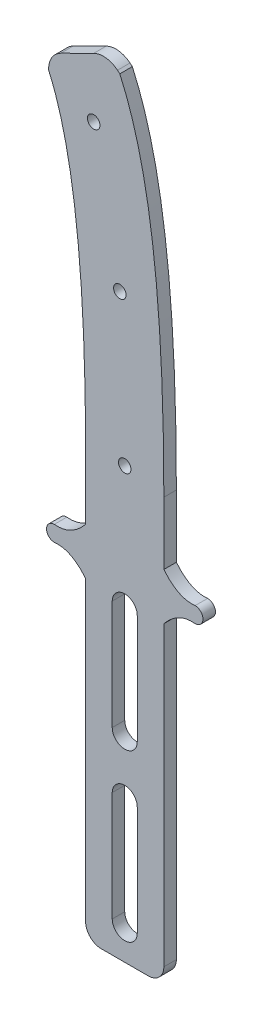
ISO-10303-21;
HEADER;
FILE_DESCRIPTION(('STEP AP214'),'2;1');
FILE_NAME('part.step','',(''),(''),'','','');
FILE_SCHEMA(('AUTOMOTIVE_DESIGN { 1 0 10303 214 1 1 1 1 }'));
ENDSEC;
DATA;
#1=APPLICATION_CONTEXT('core data for automotive mechanical design processes');
#2=APPLICATION_PROTOCOL_DEFINITION('international standard','automotive_design',2000,#1);
#3=PRODUCT_CONTEXT('',#1,'mechanical');
#4=PRODUCT('Part','Part','',(#3));
#5=PRODUCT_RELATED_PRODUCT_CATEGORY('part','',(#4));
#6=PRODUCT_DEFINITION_FORMATION('','',#4);
#7=PRODUCT_DEFINITION_CONTEXT('part definition',#1,'design');
#8=PRODUCT_DEFINITION('design','',#6,#7);
#9=PRODUCT_DEFINITION_SHAPE('','',#8);
#10=(LENGTH_UNIT() NAMED_UNIT(*) SI_UNIT(.MILLI.,.METRE.));
#11=(NAMED_UNIT(*) PLANE_ANGLE_UNIT() SI_UNIT($,.RADIAN.));
#12=(NAMED_UNIT(*) SI_UNIT($,.STERADIAN.) SOLID_ANGLE_UNIT());
#13=UNCERTAINTY_MEASURE_WITH_UNIT(LENGTH_MEASURE(1.E-05),#10,'distance_accuracy_value','');
#14=(GEOMETRIC_REPRESENTATION_CONTEXT(3) GLOBAL_UNCERTAINTY_ASSIGNED_CONTEXT((#13)) GLOBAL_UNIT_ASSIGNED_CONTEXT((#10,
#11,#12)) REPRESENTATION_CONTEXT('',''));
#15=CARTESIAN_POINT('',(0.,0.,0.));
#16=DIRECTION('',(0.,0.,1.));
#17=DIRECTION('',(1.,0.,0.));
#18=AXIS2_PLACEMENT_3D('',#15,#16,#17);
#19=CARTESIAN_POINT('',(12.4999999999998,78.,4.));
#20=DIRECTION('',(0.,0.,-1.));
#21=DIRECTION('',(-1.,0.,0.));
#22=AXIS2_PLACEMENT_3D('',#19,#20,#21);
#23=CYLINDRICAL_SURFACE('',#22,4.);
#24=CARTESIAN_POINT('',(12.4999999999998,78.,0.));
#25=DIRECTION('',(0.,0.,1.));
#26=DIRECTION('',(1.,0.,0.));
#27=AXIS2_PLACEMENT_3D('',#24,#25,#26);
#28=CIRCLE('',#27,4.);
#29=CARTESIAN_POINT('',(16.4999999999998,78.,0.));
#30=VERTEX_POINT('',#29);
#31=CARTESIAN_POINT('',(8.49999999999982,78.,0.));
#32=VERTEX_POINT('',#31);
#33=EDGE_CURVE('E361',#30,#32,#28,.T.);
#34=ORIENTED_EDGE('',*,*,#33,.F.);
#35=DIRECTION('',(0.,0.,-1.));
#36=VECTOR('',#35,1.);
#37=CARTESIAN_POINT('',(16.4999999999998,78.,4.));
#38=LINE('',#37,#36);
#39=CARTESIAN_POINT('',(16.4999999999998,78.,4.));
#40=VERTEX_POINT('',#39);
#41=EDGE_CURVE('E11',#40,#30,#38,.T.);
#42=ORIENTED_EDGE('',*,*,#41,.F.);
#43=CARTESIAN_POINT('',(12.4999999999998,78.,4.));
#44=DIRECTION('',(0.,0.,1.));
#45=DIRECTION('',(1.,0.,0.));
#46=AXIS2_PLACEMENT_3D('',#43,#44,#45);
#47=CIRCLE('',#46,4.);
#48=CARTESIAN_POINT('',(8.49999999999982,78.,4.));
#49=VERTEX_POINT('',#48);
#50=EDGE_CURVE('E247',#40,#49,#47,.T.);
#51=ORIENTED_EDGE('',*,*,#50,.T.);
#52=DIRECTION('',(0.,0.,-1.));
#53=VECTOR('',#52,1.);
#54=CARTESIAN_POINT('',(8.49999999999982,78.,4.));
#55=LINE('',#54,#53);
#56=EDGE_CURVE('E150',#49,#32,#55,.T.);
#57=ORIENTED_EDGE('',*,*,#56,.T.);
#58=EDGE_LOOP('',(#34,#42,#51,#57));
#59=FACE_BOUND('',#58,.T.);
#60=ADVANCED_FACE('F36',(#59),#23,.F.);
#61=CARTESIAN_POINT('',(16.4999999999998,0.,4.));
#62=DIRECTION('',(-1.,0.,0.));
#63=DIRECTION('',(0.,0.,1.));
#64=AXIS2_PLACEMENT_3D('',#61,#62,#63);
#65=PLANE('',#64);
#66=DIRECTION('',(0.,1.,0.));
#67=VECTOR('',#66,1.);
#68=CARTESIAN_POINT('',(16.4999999999998,0.,0.));
#69=LINE('',#68,#67);
#70=CARTESIAN_POINT('',(16.4999999999998,43.,0.));
#71=VERTEX_POINT('',#70);
#72=EDGE_CURVE('E238',#71,#30,#69,.T.);
#73=ORIENTED_EDGE('',*,*,#72,.F.);
#74=DIRECTION('',(0.,0.,-1.));
#75=VECTOR('',#74,1.);
#76=CARTESIAN_POINT('',(16.4999999999998,43.,4.));
#77=LINE('',#76,#75);
#78=CARTESIAN_POINT('',(16.4999999999998,43.,4.));
#79=VERTEX_POINT('',#78);
#80=EDGE_CURVE('E47',#79,#71,#77,.T.);
#81=ORIENTED_EDGE('',*,*,#80,.F.);
#82=DIRECTION('',(0.,1.,0.));
#83=VECTOR('',#82,1.);
#84=CARTESIAN_POINT('',(16.4999999999998,0.,4.));
#85=LINE('',#84,#83);
#86=EDGE_CURVE('E236',#79,#40,#85,.T.);
#87=ORIENTED_EDGE('',*,*,#86,.T.);
#88=ORIENTED_EDGE('',*,*,#41,.T.);
#89=EDGE_LOOP('',(#73,#81,#87,#88));
#90=FACE_BOUND('',#89,.T.);
#91=ADVANCED_FACE('F235',(#90),#65,.T.);
#92=CARTESIAN_POINT('',(12.4999999999998,43.,4.));
#93=DIRECTION('',(0.,0.,-1.));
#94=DIRECTION('',(-1.,0.,0.));
#95=AXIS2_PLACEMENT_3D('',#92,#93,#94);
#96=CYLINDRICAL_SURFACE('',#95,4.);
#97=CARTESIAN_POINT('',(12.4999999999998,43.,0.));
#98=DIRECTION('',(0.,0.,1.));
#99=DIRECTION('',(1.,0.,0.));
#100=AXIS2_PLACEMENT_3D('',#97,#98,#99);
#101=CIRCLE('',#100,4.);
#102=CARTESIAN_POINT('',(8.49999999999982,43.,0.));
#103=VERTEX_POINT('',#102);
#104=EDGE_CURVE('E365',#103,#71,#101,.T.);
#105=ORIENTED_EDGE('',*,*,#104,.F.);
#106=DIRECTION('',(0.,0.,-1.));
#107=VECTOR('',#106,1.);
#108=CARTESIAN_POINT('',(8.49999999999982,43.,4.));
#109=LINE('',#108,#107);
#110=CARTESIAN_POINT('',(8.49999999999982,43.,4.));
#111=VERTEX_POINT('',#110);
#112=EDGE_CURVE('E143',#111,#103,#109,.T.);
#113=ORIENTED_EDGE('',*,*,#112,.F.);
#114=CARTESIAN_POINT('',(12.4999999999998,43.,4.));
#115=DIRECTION('',(0.,0.,1.));
#116=DIRECTION('',(1.,0.,0.));
#117=AXIS2_PLACEMENT_3D('',#114,#115,#116);
#118=CIRCLE('',#117,4.);
#119=EDGE_CURVE('E246',#111,#79,#118,.T.);
#120=ORIENTED_EDGE('',*,*,#119,.T.);
#121=ORIENTED_EDGE('',*,*,#80,.T.);
#122=EDGE_LOOP('',(#105,#113,#120,#121));
#123=FACE_BOUND('',#122,.T.);
#124=ADVANCED_FACE('F249',(#123),#96,.F.);
#125=CARTESIAN_POINT('',(12.5,25.,4.));
#126=DIRECTION('',(0.,0.,-1.));
#127=DIRECTION('',(-1.,0.,0.));
#128=AXIS2_PLACEMENT_3D('',#125,#126,#127);
#129=CYLINDRICAL_SURFACE('',#128,4.);
#130=CARTESIAN_POINT('',(12.5,25.,0.));
#131=DIRECTION('',(0.,0.,1.));
#132=DIRECTION('',(1.,0.,0.));
#133=AXIS2_PLACEMENT_3D('',#130,#131,#132);
#134=CIRCLE('',#133,4.);
#135=CARTESIAN_POINT('',(16.5,25.,0.));
#136=VERTEX_POINT('',#135);
#137=CARTESIAN_POINT('',(8.5,25.,0.));
#138=VERTEX_POINT('',#137);
#139=EDGE_CURVE('E349',#136,#138,#134,.T.);
#140=ORIENTED_EDGE('',*,*,#139,.F.);
#141=DIRECTION('',(0.,0.,-1.));
#142=VECTOR('',#141,1.);
#143=CARTESIAN_POINT('',(16.5,25.,4.));
#144=LINE('',#143,#142);
#145=CARTESIAN_POINT('',(16.5,25.,4.));
#146=VERTEX_POINT('',#145);
#147=EDGE_CURVE('E380',#146,#136,#144,.T.);
#148=ORIENTED_EDGE('',*,*,#147,.F.);
#149=CARTESIAN_POINT('',(12.5,25.,4.));
#150=DIRECTION('',(0.,0.,1.));
#151=DIRECTION('',(1.,0.,0.));
#152=AXIS2_PLACEMENT_3D('',#149,#150,#151);
#153=CIRCLE('',#152,4.);
#154=CARTESIAN_POINT('',(8.5,25.,4.));
#155=VERTEX_POINT('',#154);
#156=EDGE_CURVE('E565',#146,#155,#153,.T.);
#157=ORIENTED_EDGE('',*,*,#156,.T.);
#158=DIRECTION('',(0.,0.,-1.));
#159=VECTOR('',#158,1.);
#160=CARTESIAN_POINT('',(8.5,25.,4.));
#161=LINE('',#160,#159);
#162=EDGE_CURVE('E382',#155,#138,#161,.T.);
#163=ORIENTED_EDGE('',*,*,#162,.T.);
#164=EDGE_LOOP('',(#140,#148,#157,#163));
#165=FACE_BOUND('',#164,.T.);
#166=ADVANCED_FACE('F534',(#165),#129,.F.);
#167=CARTESIAN_POINT('',(16.5,0.,4.));
#168=DIRECTION('',(-1.,0.,0.));
#169=DIRECTION('',(0.,0.,1.));
#170=AXIS2_PLACEMENT_3D('',#167,#168,#169);
#171=PLANE('',#170);
#172=DIRECTION('',(0.,1.,0.));
#173=VECTOR('',#172,1.);
#174=CARTESIAN_POINT('',(16.5,0.,0.));
#175=LINE('',#174,#173);
#176=CARTESIAN_POINT('',(16.5,-9.99999999999999,0.));
#177=VERTEX_POINT('',#176);
#178=EDGE_CURVE('E352',#177,#136,#175,.T.);
#179=ORIENTED_EDGE('',*,*,#178,.F.);
#180=DIRECTION('',(0.,0.,-1.));
#181=VECTOR('',#180,1.);
#182=CARTESIAN_POINT('',(16.5,-9.99999999999999,4.));
#183=LINE('',#182,#181);
#184=CARTESIAN_POINT('',(16.5,-9.99999999999999,4.));
#185=VERTEX_POINT('',#184);
#186=EDGE_CURVE('E386',#185,#177,#183,.T.);
#187=ORIENTED_EDGE('',*,*,#186,.F.);
#188=DIRECTION('',(0.,1.,0.));
#189=VECTOR('',#188,1.);
#190=CARTESIAN_POINT('',(16.5,0.,4.));
#191=LINE('',#190,#189);
#192=EDGE_CURVE('E568',#185,#146,#191,.T.);
#193=ORIENTED_EDGE('',*,*,#192,.T.);
#194=ORIENTED_EDGE('',*,*,#147,.T.);
#195=EDGE_LOOP('',(#179,#187,#193,#194));
#196=FACE_BOUND('',#195,.T.);
#197=ADVANCED_FACE('F530',(#196),#171,.T.);
#198=CARTESIAN_POINT('',(12.5,-9.99999999999999,4.));
#199=DIRECTION('',(0.,0.,-1.));
#200=DIRECTION('',(-1.,0.,0.));
#201=AXIS2_PLACEMENT_3D('',#198,#199,#200);
#202=CYLINDRICAL_SURFACE('',#201,4.);
#203=CARTESIAN_POINT('',(12.5,-9.99999999999999,0.));
#204=DIRECTION('',(0.,0.,1.));
#205=DIRECTION('',(1.,0.,0.));
#206=AXIS2_PLACEMENT_3D('',#203,#204,#205);
#207=CIRCLE('',#206,4.);
#208=CARTESIAN_POINT('',(8.5,-9.99999999999999,0.));
#209=VERTEX_POINT('',#208);
#210=EDGE_CURVE('E355',#209,#177,#207,.T.);
#211=ORIENTED_EDGE('',*,*,#210,.F.);
#212=DIRECTION('',(0.,0.,-1.));
#213=VECTOR('',#212,1.);
#214=CARTESIAN_POINT('',(8.5,-9.99999999999999,4.));
#215=LINE('',#214,#213);
#216=CARTESIAN_POINT('',(8.5,-9.99999999999999,4.));
#217=VERTEX_POINT('',#216);
#218=EDGE_CURVE('E384',#217,#209,#215,.T.);
#219=ORIENTED_EDGE('',*,*,#218,.F.);
#220=CARTESIAN_POINT('',(12.5,-9.99999999999999,4.));
#221=DIRECTION('',(0.,0.,1.));
#222=DIRECTION('',(1.,0.,0.));
#223=AXIS2_PLACEMENT_3D('',#220,#221,#222);
#224=CIRCLE('',#223,4.);
#225=EDGE_CURVE('E571',#217,#185,#224,.T.);
#226=ORIENTED_EDGE('',*,*,#225,.T.);
#227=ORIENTED_EDGE('',*,*,#186,.T.);
#228=EDGE_LOOP('',(#211,#219,#226,#227));
#229=FACE_BOUND('',#228,.T.);
#230=ADVANCED_FACE('F513',(#229),#202,.F.);
#231=CARTESIAN_POINT('',(0.,95.,4.));
#232=CARTESIAN_POINT('',(-4.58006982322337,89.4182050227499,4.));
#233=CARTESIAN_POINT('',(-10.,90.,4.));
#234=B_SPLINE_CURVE_WITH_KNOTS('',2,(#231,#232,#233),.UNSPECIFIED.,.F.,.F.,(3,3),(0.,1.),.UNSPECIFIED.);
#235=DIRECTION('',(0.,0.,-1.));
#236=VECTOR('',#235,1.);
#237=SURFACE_OF_LINEAR_EXTRUSION('',#234,#236);
#238=CARTESIAN_POINT('',(0.,95.,0.));
#239=CARTESIAN_POINT('',(-4.58006982322337,89.4182050227499,0.));
#240=CARTESIAN_POINT('',(-10.,90.,0.));
#241=B_SPLINE_CURVE_WITH_KNOTS('',2,(#238,#239,#240),.UNSPECIFIED.,.F.,.F.,(3,3),(0.,1.),.UNSPECIFIED.);
#242=CARTESIAN_POINT('',(0.,95.,0.));
#243=VERTEX_POINT('',#242);
#244=CARTESIAN_POINT('',(-10.,90.,0.));
#245=VERTEX_POINT('',#244);
#246=EDGE_CURVE('E264',#243,#245,#241,.T.);
#247=ORIENTED_EDGE('',*,*,#246,.T.);
#248=DIRECTION('',(0.,0.,-1.));
#249=VECTOR('',#248,1.);
#250=CARTESIAN_POINT('',(-10.,90.,4.));
#251=LINE('',#250,#249);
#252=CARTESIAN_POINT('',(-10.,90.,4.));
#253=VERTEX_POINT('',#252);
#254=EDGE_CURVE('E41',#253,#245,#251,.T.);
#255=ORIENTED_EDGE('',*,*,#254,.F.);
#256=CARTESIAN_POINT('',(0.,95.,4.));
#257=VERTEX_POINT('',#256);
#258=EDGE_CURVE('E378',#257,#253,#234,.T.);
#259=ORIENTED_EDGE('',*,*,#258,.F.);
#260=DIRECTION('',(0.,0.,-1.));
#261=VECTOR('',#260,1.);
#262=CARTESIAN_POINT('',(0.,95.,4.));
#263=LINE('',#262,#261);
#264=EDGE_CURVE('E263',#257,#243,#263,.T.);
#265=ORIENTED_EDGE('',*,*,#264,.T.);
#266=EDGE_LOOP('',(#247,#255,#259,#265));
#267=FACE_BOUND('',#266,.T.);
#268=ADVANCED_FACE('F38',(#267),#237,.F.);
#269=CARTESIAN_POINT('',(-10.,87.5,4.));
#270=DIRECTION('',(0.,0.,-1.));
#271=DIRECTION('',(-1.,0.,0.));
#272=AXIS2_PLACEMENT_3D('',#269,#270,#271);
#273=CYLINDRICAL_SURFACE('',#272,2.5);
#274=CARTESIAN_POINT('',(-10.,87.5,0.));
#275=DIRECTION('',(0.,0.,1.));
#276=DIRECTION('',(1.,0.,0.));
#277=AXIS2_PLACEMENT_3D('',#274,#275,#276);
#278=CIRCLE('',#277,2.5);
#279=CARTESIAN_POINT('',(-10.,85.,0.));
#280=VERTEX_POINT('',#279);
#281=EDGE_CURVE('E269',#245,#280,#278,.T.);
#282=ORIENTED_EDGE('',*,*,#281,.T.);
#283=DIRECTION('',(0.,0.,-1.));
#284=VECTOR('',#283,1.);
#285=CARTESIAN_POINT('',(-10.,85.,4.));
#286=LINE('',#285,#284);
#287=CARTESIAN_POINT('',(-10.,85.,4.));
#288=VERTEX_POINT('',#287);
#289=EDGE_CURVE('E428',#288,#280,#286,.T.);
#290=ORIENTED_EDGE('',*,*,#289,.F.);
#291=CARTESIAN_POINT('',(-10.,87.5,4.));
#292=DIRECTION('',(0.,0.,1.));
#293=DIRECTION('',(1.,0.,0.));
#294=AXIS2_PLACEMENT_3D('',#291,#292,#293);
#295=CIRCLE('',#294,2.5);
#296=EDGE_CURVE('E158',#253,#288,#295,.T.);
#297=ORIENTED_EDGE('',*,*,#296,.F.);
#298=ORIENTED_EDGE('',*,*,#254,.T.);
#299=EDGE_LOOP('',(#282,#290,#297,#298));
#300=FACE_BOUND('',#299,.T.);
#301=ADVANCED_FACE('F433',(#300),#273,.T.);
#302=CARTESIAN_POINT('',(0.,80.,4.));
#303=CARTESIAN_POINT('',(-4.58006982322337,85.5817949772501,4.));
#304=CARTESIAN_POINT('',(-10.,85.,4.));
#305=B_SPLINE_CURVE_WITH_KNOTS('',2,(#302,#303,#304),.UNSPECIFIED.,.F.,.F.,(3,3),(0.,1.),.UNSPECIFIED.);
#306=DIRECTION('',(0.,0.,-1.));
#307=VECTOR('',#306,1.);
#308=SURFACE_OF_LINEAR_EXTRUSION('',#305,#307);
#309=CARTESIAN_POINT('',(0.,80.,0.));
#310=CARTESIAN_POINT('',(-4.58006982322337,85.5817949772501,0.));
#311=CARTESIAN_POINT('',(-10.,85.,0.));
#312=B_SPLINE_CURVE_WITH_KNOTS('',2,(#309,#310,#311),.UNSPECIFIED.,.F.,.F.,(3,3),(0.,1.),.UNSPECIFIED.);
#313=CARTESIAN_POINT('',(0.,80.,0.));
#314=VERTEX_POINT('',#313);
#315=EDGE_CURVE('E275',#314,#280,#312,.T.);
#316=ORIENTED_EDGE('',*,*,#315,.F.);
#317=DIRECTION('',(0.,0.,-1.));
#318=VECTOR('',#317,1.);
#319=CARTESIAN_POINT('',(0.,80.,4.));
#320=LINE('',#319,#318);
#321=CARTESIAN_POINT('',(0.,80.,4.));
#322=VERTEX_POINT('',#321);
#323=EDGE_CURVE('E427',#322,#314,#320,.T.);
#324=ORIENTED_EDGE('',*,*,#323,.F.);
#325=EDGE_CURVE('E447',#322,#288,#305,.T.);
#326=ORIENTED_EDGE('',*,*,#325,.T.);
#327=ORIENTED_EDGE('',*,*,#289,.T.);
#328=EDGE_LOOP('',(#316,#324,#326,#327));
#329=FACE_BOUND('',#328,.T.);
#330=ADVANCED_FACE('F445',(#329),#308,.T.);
#331=CARTESIAN_POINT('',(0.,0.,4.));
#332=DIRECTION('',(-1.,0.,0.));
#333=DIRECTION('',(0.,0.,1.));
#334=AXIS2_PLACEMENT_3D('',#331,#332,#333);
#335=PLANE('',#334);
#336=DIRECTION('',(0.,1.,0.));
#337=VECTOR('',#336,1.);
#338=CARTESIAN_POINT('',(0.,0.,0.));
#339=LINE('',#338,#337);
#340=CARTESIAN_POINT('',(0.,-15.,0.));
#341=VERTEX_POINT('',#340);
#342=EDGE_CURVE('E280',#341,#314,#339,.T.);
#343=ORIENTED_EDGE('',*,*,#342,.F.);
#344=DIRECTION('',(0.,0.,-1.));
#345=VECTOR('',#344,1.);
#346=CARTESIAN_POINT('',(0.,-15.,4.));
#347=LINE('',#346,#345);
#348=CARTESIAN_POINT('',(0.,-15.,4.));
#349=VERTEX_POINT('',#348);
#350=EDGE_CURVE('E425',#349,#341,#347,.T.);
#351=ORIENTED_EDGE('',*,*,#350,.F.);
#352=DIRECTION('',(0.,1.,0.));
#353=VECTOR('',#352,1.);
#354=CARTESIAN_POINT('',(0.,0.,4.));
#355=LINE('',#354,#353);
#356=EDGE_CURVE('E453',#349,#322,#355,.T.);
#357=ORIENTED_EDGE('',*,*,#356,.T.);
#358=ORIENTED_EDGE('',*,*,#323,.T.);
#359=EDGE_LOOP('',(#343,#351,#357,#358));
#360=FACE_BOUND('',#359,.T.);
#361=ADVANCED_FACE('F455',(#360),#335,.T.);
#362=CARTESIAN_POINT('',(5.,-15.,4.));
#363=DIRECTION('',(0.,0.,-1.));
#364=DIRECTION('',(-1.,0.,0.));
#365=AXIS2_PLACEMENT_3D('',#362,#363,#364);
#366=CYLINDRICAL_SURFACE('',#365,5.);
#367=CARTESIAN_POINT('',(5.,-15.,0.));
#368=DIRECTION('',(0.,0.,1.));
#369=DIRECTION('',(1.,0.,0.));
#370=AXIS2_PLACEMENT_3D('',#367,#368,#369);
#371=CIRCLE('',#370,5.);
#372=CARTESIAN_POINT('',(5.00000000000004,-20.,0.));
#373=VERTEX_POINT('',#372);
#374=EDGE_CURVE('E286',#341,#373,#371,.T.);
#375=ORIENTED_EDGE('',*,*,#374,.T.);
#376=DIRECTION('',(0.,0.,-1.));
#377=VECTOR('',#376,1.);
#378=CARTESIAN_POINT('',(5.00000000000004,-20.,4.));
#379=LINE('',#378,#377);
#380=CARTESIAN_POINT('',(5.00000000000004,-20.,4.));
#381=VERTEX_POINT('',#380);
#382=EDGE_CURVE('E422',#381,#373,#379,.T.);
#383=ORIENTED_EDGE('',*,*,#382,.F.);
#384=CARTESIAN_POINT('',(5.,-15.,4.));
#385=DIRECTION('',(0.,0.,1.));
#386=DIRECTION('',(1.,0.,0.));
#387=AXIS2_PLACEMENT_3D('',#384,#385,#386);
#388=CIRCLE('',#387,5.);
#389=EDGE_CURVE('E457',#349,#381,#388,.T.);
#390=ORIENTED_EDGE('',*,*,#389,.F.);
#391=ORIENTED_EDGE('',*,*,#350,.T.);
#392=EDGE_LOOP('',(#375,#383,#390,#391));
#393=FACE_BOUND('',#392,.T.);
#394=ADVANCED_FACE('F501',(#393),#366,.T.);
#395=CARTESIAN_POINT('',(0.,-20.,4.));
#396=DIRECTION('',(0.,1.,0.));
#397=DIRECTION('',(0.,0.,1.));
#398=AXIS2_PLACEMENT_3D('',#395,#396,#397);
#399=PLANE('',#398);
#400=DIRECTION('',(1.,0.,0.));
#401=VECTOR('',#400,1.);
#402=CARTESIAN_POINT('',(0.,-20.,0.));
#403=LINE('',#402,#401);
#404=CARTESIAN_POINT('',(20.,-20.,0.));
#405=VERTEX_POINT('',#404);
#406=EDGE_CURVE('E288',#373,#405,#403,.T.);
#407=ORIENTED_EDGE('',*,*,#406,.T.);
#408=DIRECTION('',(0.,0.,-1.));
#409=VECTOR('',#408,1.);
#410=CARTESIAN_POINT('',(20.,-20.,4.));
#411=LINE('',#410,#409);
#412=CARTESIAN_POINT('',(20.,-20.,4.));
#413=VERTEX_POINT('',#412);
#414=EDGE_CURVE('E419',#413,#405,#411,.T.);
#415=ORIENTED_EDGE('',*,*,#414,.F.);
#416=DIRECTION('',(1.,0.,0.));
#417=VECTOR('',#416,1.);
#418=CARTESIAN_POINT('',(0.,-20.,4.));
#419=LINE('',#418,#417);
#420=EDGE_CURVE('E459',#381,#413,#419,.T.);
#421=ORIENTED_EDGE('',*,*,#420,.F.);
#422=ORIENTED_EDGE('',*,*,#382,.T.);
#423=EDGE_LOOP('',(#407,#415,#421,#422));
#424=FACE_BOUND('',#423,.T.);
#425=ADVANCED_FACE('F497',(#424),#399,.F.);
#426=CARTESIAN_POINT('',(20.,-15.,4.));
#427=DIRECTION('',(0.,0.,-1.));
#428=DIRECTION('',(-1.,0.,0.));
#429=AXIS2_PLACEMENT_3D('',#426,#427,#428);
#430=CYLINDRICAL_SURFACE('',#429,5.);
#431=CARTESIAN_POINT('',(20.,-15.,0.));
#432=DIRECTION('',(0.,0.,1.));
#433=DIRECTION('',(1.,0.,0.));
#434=AXIS2_PLACEMENT_3D('',#431,#432,#433);
#435=CIRCLE('',#434,5.);
#436=CARTESIAN_POINT('',(25.,-15.,0.));
#437=VERTEX_POINT('',#436);
#438=EDGE_CURVE('E290',#405,#437,#435,.T.);
#439=ORIENTED_EDGE('',*,*,#438,.T.);
#440=DIRECTION('',(0.,0.,-1.));
#441=VECTOR('',#440,1.);
#442=CARTESIAN_POINT('',(25.,-15.,4.));
#443=LINE('',#442,#441);
#444=CARTESIAN_POINT('',(25.,-15.,4.));
#445=VERTEX_POINT('',#444);
#446=EDGE_CURVE('E417',#445,#437,#443,.T.);
#447=ORIENTED_EDGE('',*,*,#446,.F.);
#448=CARTESIAN_POINT('',(20.,-15.,4.));
#449=DIRECTION('',(0.,0.,1.));
#450=DIRECTION('',(1.,0.,0.));
#451=AXIS2_PLACEMENT_3D('',#448,#449,#450);
#452=CIRCLE('',#451,5.);
#453=EDGE_CURVE('E467',#413,#445,#452,.T.);
#454=ORIENTED_EDGE('',*,*,#453,.F.);
#455=ORIENTED_EDGE('',*,*,#414,.T.);
#456=EDGE_LOOP('',(#439,#447,#454,#455));
#457=FACE_BOUND('',#456,.T.);
#458=ADVANCED_FACE('F493',(#457),#430,.T.);
#459=CARTESIAN_POINT('',(25.,0.,4.));
#460=DIRECTION('',(1.,0.,0.));
#461=DIRECTION('',(0.,1.,0.));
#462=AXIS2_PLACEMENT_3D('',#459,#460,#461);
#463=PLANE('',#462);
#464=DIRECTION('',(0.,-1.,0.));
#465=VECTOR('',#464,1.);
#466=CARTESIAN_POINT('',(25.,0.,0.));
#467=LINE('',#466,#465);
#468=CARTESIAN_POINT('',(25.,80.,0.));
#469=VERTEX_POINT('',#468);
#470=EDGE_CURVE('E293',#469,#437,#467,.T.);
#471=ORIENTED_EDGE('',*,*,#470,.F.);
#472=DIRECTION('',(0.,0.,-1.));
#473=VECTOR('',#472,1.);
#474=CARTESIAN_POINT('',(25.,80.,4.));
#475=LINE('',#474,#473);
#476=CARTESIAN_POINT('',(25.,80.,4.));
#477=VERTEX_POINT('',#476);
#478=EDGE_CURVE('E415',#477,#469,#475,.T.);
#479=ORIENTED_EDGE('',*,*,#478,.F.);
#480=DIRECTION('',(0.,-1.,0.));
#481=VECTOR('',#480,1.);
#482=CARTESIAN_POINT('',(25.,0.,4.));
#483=LINE('',#482,#481);
#484=EDGE_CURVE('E469',#477,#445,#483,.T.);
#485=ORIENTED_EDGE('',*,*,#484,.T.);
#486=ORIENTED_EDGE('',*,*,#446,.T.);
#487=EDGE_LOOP('',(#471,#479,#485,#486));
#488=FACE_BOUND('',#487,.T.);
#489=ADVANCED_FACE('F488',(#488),#463,.T.);
#490=CARTESIAN_POINT('',(25.,80.,4.));
#491=CARTESIAN_POINT('',(29.5800698232234,85.5817949772501,4.));
#492=CARTESIAN_POINT('',(35.,85.,4.));
#493=B_SPLINE_CURVE_WITH_KNOTS('',2,(#490,#491,#492),.UNSPECIFIED.,.F.,.F.,(3,3),(0.,1.),.UNSPECIFIED.);
#494=DIRECTION('',(0.,0.,-1.));
#495=VECTOR('',#494,1.);
#496=SURFACE_OF_LINEAR_EXTRUSION('',#493,#495);
#497=CARTESIAN_POINT('',(25.,80.,0.));
#498=CARTESIAN_POINT('',(29.5800698232234,85.5817949772501,0.));
#499=CARTESIAN_POINT('',(35.,85.,0.));
#500=B_SPLINE_CURVE_WITH_KNOTS('',2,(#497,#498,#499),.UNSPECIFIED.,.F.,.F.,(3,3),(0.,1.),.UNSPECIFIED.);
#501=CARTESIAN_POINT('',(35.,85.,0.));
#502=VERTEX_POINT('',#501);
#503=EDGE_CURVE('E296',#469,#502,#500,.T.);
#504=ORIENTED_EDGE('',*,*,#503,.T.);
#505=DIRECTION('',(0.,0.,-1.));
#506=VECTOR('',#505,1.);
#507=CARTESIAN_POINT('',(35.,85.,4.));
#508=LINE('',#507,#506);
#509=CARTESIAN_POINT('',(35.,85.,4.));
#510=VERTEX_POINT('',#509);
#511=EDGE_CURVE('E412',#510,#502,#508,.T.);
#512=ORIENTED_EDGE('',*,*,#511,.F.);
#513=EDGE_CURVE('E472',#477,#510,#493,.T.);
#514=ORIENTED_EDGE('',*,*,#513,.F.);
#515=ORIENTED_EDGE('',*,*,#478,.T.);
#516=EDGE_LOOP('',(#504,#512,#514,#515));
#517=FACE_BOUND('',#516,.T.);
#518=ADVANCED_FACE('F483',(#517),#496,.F.);
#519=CARTESIAN_POINT('',(35.,87.5,4.));
#520=DIRECTION('',(0.,0.,-1.));
#521=DIRECTION('',(-1.,0.,0.));
#522=AXIS2_PLACEMENT_3D('',#519,#520,#521);
#523=CYLINDRICAL_SURFACE('',#522,2.5);
#524=CARTESIAN_POINT('',(35.,87.5,0.));
#525=DIRECTION('',(0.,0.,1.));
#526=DIRECTION('',(1.,0.,0.));
#527=AXIS2_PLACEMENT_3D('',#524,#525,#526);
#528=CIRCLE('',#527,2.5);
#529=CARTESIAN_POINT('',(35.,90.,0.));
#530=VERTEX_POINT('',#529);
#531=EDGE_CURVE('E300',#502,#530,#528,.T.);
#532=ORIENTED_EDGE('',*,*,#531,.T.);
#533=DIRECTION('',(0.,0.,-1.));
#534=VECTOR('',#533,1.);
#535=CARTESIAN_POINT('',(35.,90.,4.));
#536=LINE('',#535,#534);
#537=CARTESIAN_POINT('',(35.,90.,4.));
#538=VERTEX_POINT('',#537);
#539=EDGE_CURVE('E410',#538,#530,#536,.T.);
#540=ORIENTED_EDGE('',*,*,#539,.F.);
#541=CARTESIAN_POINT('',(35.,87.5,4.));
#542=DIRECTION('',(0.,0.,1.));
#543=DIRECTION('',(1.,0.,0.));
#544=AXIS2_PLACEMENT_3D('',#541,#542,#543);
#545=CIRCLE('',#544,2.5);
#546=EDGE_CURVE('E477',#510,#538,#545,.T.);
#547=ORIENTED_EDGE('',*,*,#546,.F.);
#548=ORIENTED_EDGE('',*,*,#511,.T.);
#549=EDGE_LOOP('',(#532,#540,#547,#548));
#550=FACE_BOUND('',#549,.T.);
#551=ADVANCED_FACE('F487',(#550),#523,.T.);
#552=CARTESIAN_POINT('',(25.,95.,4.));
#553=CARTESIAN_POINT('',(29.5800698232234,89.4182050227499,4.));
#554=CARTESIAN_POINT('',(35.,90.,4.));
#555=B_SPLINE_CURVE_WITH_KNOTS('',2,(#552,#553,#554),.UNSPECIFIED.,.F.,.F.,(3,3),(0.,1.),.UNSPECIFIED.);
#556=DIRECTION('',(0.,0.,-1.));
#557=VECTOR('',#556,1.);
#558=SURFACE_OF_LINEAR_EXTRUSION('',#555,#557);
#559=CARTESIAN_POINT('',(25.,95.,0.));
#560=CARTESIAN_POINT('',(29.5800698232234,89.4182050227499,0.));
#561=CARTESIAN_POINT('',(35.,90.,0.));
#562=B_SPLINE_CURVE_WITH_KNOTS('',2,(#559,#560,#561),.UNSPECIFIED.,.F.,.F.,(3,3),(0.,1.),.UNSPECIFIED.);
#563=CARTESIAN_POINT('',(25.,95.,0.));
#564=VERTEX_POINT('',#563);
#565=EDGE_CURVE('E306',#564,#530,#562,.T.);
#566=ORIENTED_EDGE('',*,*,#565,.F.);
#567=DIRECTION('',(0.,0.,-1.));
#568=VECTOR('',#567,1.);
#569=CARTESIAN_POINT('',(25.,95.,4.));
#570=LINE('',#569,#568);
#571=CARTESIAN_POINT('',(25.,95.,4.));
#572=VERTEX_POINT('',#571);
#573=EDGE_CURVE('E408',#572,#564,#570,.T.);
#574=ORIENTED_EDGE('',*,*,#573,.F.);
#575=EDGE_CURVE('E843',#572,#538,#555,.T.);
#576=ORIENTED_EDGE('',*,*,#575,.T.);
#577=ORIENTED_EDGE('',*,*,#539,.T.);
#578=EDGE_LOOP('',(#566,#574,#576,#577));
#579=FACE_BOUND('',#578,.T.);
#580=ADVANCED_FACE('F663',(#579),#558,.T.);
#581=CARTESIAN_POINT('',(25.,0.,4.));
#582=DIRECTION('',(1.,0.,0.));
#583=DIRECTION('',(0.,0.,-1.));
#584=AXIS2_PLACEMENT_3D('',#581,#582,#583);
#585=PLANE('',#584);
#586=DIRECTION('',(0.,-1.,0.));
#587=VECTOR('',#586,1.);
#588=CARTESIAN_POINT('',(25.,0.,0.));
#589=LINE('',#588,#587);
#590=CARTESIAN_POINT('',(25.,115.,0.));
#591=VERTEX_POINT('',#590);
#592=EDGE_CURVE('E311',#591,#564,#589,.T.);
#593=ORIENTED_EDGE('',*,*,#592,.F.);
#594=DIRECTION('',(0.,0.,-1.));
#595=VECTOR('',#594,1.);
#596=CARTESIAN_POINT('',(25.,115.,4.));
#597=LINE('',#596,#595);
#598=CARTESIAN_POINT('',(25.,115.,4.));
#599=VERTEX_POINT('',#598);
#600=EDGE_CURVE('E406',#599,#591,#597,.T.);
#601=ORIENTED_EDGE('',*,*,#600,.F.);
#602=DIRECTION('',(0.,-1.,0.));
#603=VECTOR('',#602,1.);
#604=CARTESIAN_POINT('',(25.,0.,4.));
#605=LINE('',#604,#603);
#606=EDGE_CURVE('E839',#599,#572,#605,.T.);
#607=ORIENTED_EDGE('',*,*,#606,.T.);
#608=ORIENTED_EDGE('',*,*,#573,.T.);
#609=EDGE_LOOP('',(#593,#601,#607,#608));
#610=FACE_BOUND('',#609,.T.);
#611=ADVANCED_FACE('F672',(#610),#585,.T.);
#612=CARTESIAN_POINT('',(25.,115.,4.));
#613=CARTESIAN_POINT('',(25.0012048224569,129.211053509505,4.));
#614=CARTESIAN_POINT('',(24.1377873514335,154.495125378925,4.));
#615=CARTESIAN_POINT('',(22.3804627742528,176.729339584373,4.));
#616=CARTESIAN_POINT('',(20.0942771087378,192.884242442991,4.));
#617=CARTESIAN_POINT('',(17.7647484623135,204.645244522672,4.));
#618=CARTESIAN_POINT('',(15.1936232897448,214.033612370515,4.));
#619=CARTESIAN_POINT('',(12.5414191425901,221.593812890793,4.));
#620=CARTESIAN_POINT('',(10.9244037242233,225.168293258689,4.));
#621=B_SPLINE_CURVE_WITH_KNOTS('',2,(#612,#613,#614,#615,#616,#617,#618,#619,#620),
.UNSPECIFIED.,.F.,.F.,(3,1,1,1,1,1,1,3),(0.,0.1875,0.375,0.5625,0.6875,0.8125,0.90625,1.),.UNSPECIFIED.);
#622=DIRECTION('',(0.,0.,-1.));
#623=VECTOR('',#622,1.);
#624=SURFACE_OF_LINEAR_EXTRUSION('',#621,#623);
#625=CARTESIAN_POINT('',(25.,115.,0.));
#626=CARTESIAN_POINT('',(25.0012048224569,129.211053509505,0.));
#627=CARTESIAN_POINT('',(24.1377873514335,154.495125378925,0.));
#628=CARTESIAN_POINT('',(22.3804627742528,176.729339584373,0.));
#629=CARTESIAN_POINT('',(20.0942771087378,192.884242442991,0.));
#630=CARTESIAN_POINT('',(17.7647484623135,204.645244522672,0.));
#631=CARTESIAN_POINT('',(15.1936232897448,214.033612370515,0.));
#632=CARTESIAN_POINT('',(12.5414191425901,221.593812890793,0.));
#633=CARTESIAN_POINT('',(10.9244037242233,225.168293258689,0.));
#634=B_SPLINE_CURVE_WITH_KNOTS('',2,(#625,#626,#627,#628,#629,#630,#631,#632,#633),
.UNSPECIFIED.,.F.,.F.,(3,1,1,1,1,1,1,3),(0.,0.1875,0.375,0.5625,0.6875,0.8125,0.90625,1.),.UNSPECIFIED.);
#635=CARTESIAN_POINT('',(10.9244037242233,225.168293258689,0.));
#636=VERTEX_POINT('',#635);
#637=EDGE_CURVE('E317',#591,#636,#634,.T.);
#638=ORIENTED_EDGE('',*,*,#637,.T.);
#639=DIRECTION('',(0.,0.,-1.));
#640=VECTOR('',#639,1.);
#641=CARTESIAN_POINT('',(10.9244037242233,225.168293258689,4.));
#642=LINE('',#641,#640);
#643=CARTESIAN_POINT('',(10.9244037242233,225.168293258689,4.));
#644=VERTEX_POINT('',#643);
#645=EDGE_CURVE('E404',#644,#636,#642,.T.);
#646=ORIENTED_EDGE('',*,*,#645,.F.);
#647=EDGE_CURVE('E834',#599,#644,#621,.T.);
#648=ORIENTED_EDGE('',*,*,#647,.F.);
#649=ORIENTED_EDGE('',*,*,#600,.T.);
#650=EDGE_LOOP('',(#638,#646,#648,#649));
#651=FACE_BOUND('',#650,.T.);
#652=ADVANCED_FACE('F682',(#651),#624,.F.);
#653=CARTESIAN_POINT('',(115.162489269794,138.485356332989,4.));
#654=DIRECTION('',(0.639391196733159,0.768881588763926,0.));
#655=DIRECTION('',(-0.768881588763926,0.639391196733159,0.));
#656=AXIS2_PLACEMENT_3D('',#653,#654,#655);
#657=PLANE('',#656);
#658=DIRECTION('',(0.768881588763926,-0.639391196733159,0.));
#659=VECTOR('',#658,1.);
#660=CARTESIAN_POINT('',(115.162489269794,138.485356332989,0.));
#661=LINE('',#660,#659);
#662=CARTESIAN_POINT('',(10.1763371165527,225.790375007692,0.));
#663=VERTEX_POINT('',#662);
#664=EDGE_CURVE('E322',#663,#636,#661,.T.);
#665=ORIENTED_EDGE('',*,*,#664,.F.);
#666=DIRECTION('',(0.,0.,-1.));
#667=VECTOR('',#666,1.);
#668=CARTESIAN_POINT('',(10.1763371165527,225.790375007692,4.));
#669=LINE('',#668,#667);
#670=CARTESIAN_POINT('',(10.1763371165527,225.790375007692,4.));
#671=VERTEX_POINT('',#670);
#672=EDGE_CURVE('E402',#671,#663,#669,.T.);
#673=ORIENTED_EDGE('',*,*,#672,.F.);
#674=DIRECTION('',(0.768881588763926,-0.639391196733159,0.));
#675=VECTOR('',#674,1.);
#676=CARTESIAN_POINT('',(115.162489269794,138.485356332989,4.));
#677=LINE('',#676,#675);
#678=EDGE_CURVE('E831',#671,#644,#677,.T.);
#679=ORIENTED_EDGE('',*,*,#678,.T.);
#680=ORIENTED_EDGE('',*,*,#645,.T.);
#681=EDGE_LOOP('',(#665,#673,#679,#680));
#682=FACE_BOUND('',#681,.T.);
#683=ADVANCED_FACE('F692',(#682),#657,.T.);
#684=CARTESIAN_POINT('',(5.70059873942051,220.408203886345,4.));
#685=DIRECTION('',(0.,0.,-1.));
#686=DIRECTION('',(-1.,0.,0.));
#687=AXIS2_PLACEMENT_3D('',#684,#685,#686);
#688=CYLINDRICAL_SURFACE('',#687,7.00000000000001);
#689=CARTESIAN_POINT('',(5.70059873942051,220.408203886345,0.));
#690=DIRECTION('',(0.,0.,1.));
#691=DIRECTION('',(1.,0.,0.));
#692=AXIS2_PLACEMENT_3D('',#689,#690,#691);
#693=CIRCLE('',#692,7.00000000000001);
#694=CARTESIAN_POINT('',(2.58180780478298,226.675032678168,0.));
#695=VERTEX_POINT('',#694);
#696=EDGE_CURVE('E328',#695,#663,#693,.F.);
#697=ORIENTED_EDGE('',*,*,#696,.F.);
#698=DIRECTION('',(0.,0.,-1.));
#699=VECTOR('',#698,1.);
#700=CARTESIAN_POINT('',(2.58180780478298,226.675032678168,4.));
#701=LINE('',#700,#699);
#702=CARTESIAN_POINT('',(2.58180780478298,226.675032678168,4.));
#703=VERTEX_POINT('',#702);
#704=EDGE_CURVE('E400',#703,#695,#701,.T.);
#705=ORIENTED_EDGE('',*,*,#704,.F.);
#706=CARTESIAN_POINT('',(5.70059873942051,220.408203886345,4.));
#707=DIRECTION('',(0.,0.,1.));
#708=DIRECTION('',(1.,0.,0.));
#709=AXIS2_PLACEMENT_3D('',#706,#707,#708);
#710=CIRCLE('',#709,7.00000000000001);
#711=EDGE_CURVE('E826',#703,#671,#710,.F.);
#712=ORIENTED_EDGE('',*,*,#711,.T.);
#713=ORIENTED_EDGE('',*,*,#672,.T.);
#714=EDGE_LOOP('',(#697,#705,#712,#713));
#715=FACE_BOUND('',#714,.T.);
#716=ADVANCED_FACE('F702',(#715),#688,.T.);
#717=CARTESIAN_POINT('',(-89.9027450004782,180.64856626833,4.));
#718=DIRECTION('',(-0.445541562091071,0.895261255974729,0.));
#719=DIRECTION('',(-0.895261255974729,-0.445541562091071,0.));
#720=AXIS2_PLACEMENT_3D('',#717,#718,#719);
#721=PLANE('',#720);
#722=DIRECTION('',(0.895261255974729,0.445541562091071,0.));
#723=VECTOR('',#722,1.);
#724=CARTESIAN_POINT('',(-89.9027450004782,180.64856626833,0.));
#725=LINE('',#724,#723);
#726=CARTESIAN_POINT('',(-7.94987048868415,221.433768893997,0.));
#727=VERTEX_POINT('',#726);
#728=EDGE_CURVE('E331',#727,#695,#725,.T.);
#729=ORIENTED_EDGE('',*,*,#728,.F.);
#730=DIRECTION('',(0.,0.,-1.));
#731=VECTOR('',#730,1.);
#732=CARTESIAN_POINT('',(-7.94987048868415,221.433768893997,4.));
#733=LINE('',#732,#731);
#734=CARTESIAN_POINT('',(-7.94987048868415,221.433768893997,4.));
#735=VERTEX_POINT('',#734);
#736=EDGE_CURVE('E398',#735,#727,#733,.T.);
#737=ORIENTED_EDGE('',*,*,#736,.F.);
#738=DIRECTION('',(0.895261255974729,0.445541562091071,0.));
#739=VECTOR('',#738,1.);
#740=CARTESIAN_POINT('',(-89.9027450004782,180.64856626833,4.));
#741=LINE('',#740,#739);
#742=EDGE_CURVE('E824',#735,#703,#741,.T.);
#743=ORIENTED_EDGE('',*,*,#742,.T.);
#744=ORIENTED_EDGE('',*,*,#704,.T.);
#745=EDGE_LOOP('',(#729,#737,#743,#744));
#746=FACE_BOUND('',#745,.T.);
#747=ADVANCED_FACE('F712',(#746),#721,.T.);
#748=CARTESIAN_POINT('',(-4.83107955404668,215.166940102173,4.));
#749=DIRECTION('',(0.,0.,-1.));
#750=DIRECTION('',(-1.,0.,0.));
#751=AXIS2_PLACEMENT_3D('',#748,#749,#750);
#752=CYLINDRICAL_SURFACE('',#751,7.);
#753=CARTESIAN_POINT('',(-4.83107955404668,215.166940102173,0.));
#754=DIRECTION('',(0.,0.,1.));
#755=DIRECTION('',(1.,0.,0.));
#756=AXIS2_PLACEMENT_3D('',#753,#754,#755);
#757=CIRCLE('',#756,7.);
#758=CARTESIAN_POINT('',(-11.8310795540467,215.166940102173,0.));
#759=VERTEX_POINT('',#758);
#760=EDGE_CURVE('E334',#727,#759,#757,.T.);
#761=ORIENTED_EDGE('',*,*,#760,.T.);
#762=DIRECTION('',(0.,0.,-1.));
#763=VECTOR('',#762,1.);
#764=CARTESIAN_POINT('',(-11.8310795540467,215.166940102173,4.));
#765=LINE('',#764,#763);
#766=CARTESIAN_POINT('',(-11.8310795540467,215.166940102173,4.));
#767=VERTEX_POINT('',#766);
#768=EDGE_CURVE('E395',#767,#759,#765,.T.);
#769=ORIENTED_EDGE('',*,*,#768,.F.);
#770=CARTESIAN_POINT('',(-4.83107955404668,215.166940102173,4.));
#771=DIRECTION('',(0.,0.,1.));
#772=DIRECTION('',(1.,0.,0.));
#773=AXIS2_PLACEMENT_3D('',#770,#771,#772);
#774=CIRCLE('',#773,7.);
#775=EDGE_CURVE('E823',#735,#767,#774,.T.);
#776=ORIENTED_EDGE('',*,*,#775,.F.);
#777=ORIENTED_EDGE('',*,*,#736,.T.);
#778=EDGE_LOOP('',(#761,#769,#776,#777));
#779=FACE_BOUND('',#778,.T.);
#780=ADVANCED_FACE('F722',(#779),#752,.T.);
#781=CARTESIAN_POINT('',(-11.8310795540467,0.,4.));
#782=DIRECTION('',(1.,0.,0.));
#783=DIRECTION('',(0.,0.,-1.));
#784=AXIS2_PLACEMENT_3D('',#781,#782,#783);
#785=PLANE('',#784);
#786=DIRECTION('',(0.,-1.,0.));
#787=VECTOR('',#786,1.);
#788=CARTESIAN_POINT('',(-11.8310795540467,0.,0.));
#789=LINE('',#788,#787);
#790=CARTESIAN_POINT('',(-11.8310795540467,214.815130419615,0.));
#791=VERTEX_POINT('',#790);
#792=EDGE_CURVE('E336',#759,#791,#789,.T.);
#793=ORIENTED_EDGE('',*,*,#792,.T.);
#794=DIRECTION('',(0.,0.,-1.));
#795=VECTOR('',#794,1.);
#796=CARTESIAN_POINT('',(-11.8310795540467,214.815130419615,4.));
#797=LINE('',#796,#795);
#798=CARTESIAN_POINT('',(-11.8310795540467,214.815130419615,4.));
#799=VERTEX_POINT('',#798);
#800=EDGE_CURVE('E393',#799,#791,#797,.T.);
#801=ORIENTED_EDGE('',*,*,#800,.F.);
#802=DIRECTION('',(0.,-1.,0.));
#803=VECTOR('',#802,1.);
#804=CARTESIAN_POINT('',(-11.8310795540467,0.,4.));
#805=LINE('',#804,#803);
#806=EDGE_CURVE('E559',#767,#799,#805,.T.);
#807=ORIENTED_EDGE('',*,*,#806,.F.);
#808=ORIENTED_EDGE('',*,*,#768,.T.);
#809=EDGE_LOOP('',(#793,#801,#807,#808));
#810=FACE_BOUND('',#809,.T.);
#811=ADVANCED_FACE('F548',(#810),#785,.F.);
#812=CARTESIAN_POINT('',(0.,115.,4.));
#813=CARTESIAN_POINT('',(0.,188.811295925684,4.));
#814=CARTESIAN_POINT('',(-11.8310795540467,214.815130419615,4.));
#815=B_SPLINE_CURVE_WITH_KNOTS('',2,(#812,#813,#814),.UNSPECIFIED.,.F.,.F.,(3,3),(0.,1.),.UNSPECIFIED.);
#816=DIRECTION('',(0.,0.,-1.));
#817=VECTOR('',#816,1.);
#818=SURFACE_OF_LINEAR_EXTRUSION('',#815,#817);
#819=CARTESIAN_POINT('',(0.,115.,0.));
#820=CARTESIAN_POINT('',(0.,188.811295925684,0.));
#821=CARTESIAN_POINT('',(-11.8310795540467,214.815130419615,0.));
#822=B_SPLINE_CURVE_WITH_KNOTS('',2,(#819,#820,#821),.UNSPECIFIED.,.F.,.F.,(3,3),(0.,1.),.UNSPECIFIED.);
#823=CARTESIAN_POINT('',(0.,115.,0.));
#824=VERTEX_POINT('',#823);
#825=EDGE_CURVE('E339',#824,#791,#822,.T.);
#826=ORIENTED_EDGE('',*,*,#825,.F.);
#827=DIRECTION('',(0.,0.,-1.));
#828=VECTOR('',#827,1.);
#829=CARTESIAN_POINT('',(0.,115.,4.));
#830=LINE('',#829,#828);
#831=CARTESIAN_POINT('',(0.,115.,4.));
#832=VERTEX_POINT('',#831);
#833=EDGE_CURVE('E391',#832,#824,#830,.T.);
#834=ORIENTED_EDGE('',*,*,#833,.F.);
#835=EDGE_CURVE('E551',#832,#799,#815,.T.);
#836=ORIENTED_EDGE('',*,*,#835,.T.);
#837=ORIENTED_EDGE('',*,*,#800,.T.);
#838=EDGE_LOOP('',(#826,#834,#836,#837));
#839=FACE_BOUND('',#838,.T.);
#840=ADVANCED_FACE('F543',(#839),#818,.T.);
#841=CARTESIAN_POINT('',(10.9244037242233,164.911196929082,4.));
#842=DIRECTION('',(0.,0.,-1.));
#843=DIRECTION('',(-1.,0.,0.));
#844=AXIS2_PLACEMENT_3D('',#841,#842,#843);
#845=CYLINDRICAL_SURFACE('',#844,2.);
#846=CARTESIAN_POINT('',(10.9244037242233,164.911196929082,4.));
#847=DIRECTION('',(0.,0.,1.));
#848=DIRECTION('',(1.,0.,0.));
#849=AXIS2_PLACEMENT_3D('',#846,#847,#848);
#850=CIRCLE('',#849,2.);
#851=CARTESIAN_POINT('',(12.9244037242233,164.911196929082,4.));
#852=VERTEX_POINT('',#851);
#853=EDGE_CURVE('E257',#852,#852,#850,.T.);
#854=ORIENTED_EDGE('',*,*,#853,.T.);
#855=EDGE_LOOP('',(#854));
#856=FACE_BOUND('',#855,.T.);
#857=CARTESIAN_POINT('',(10.9244037242233,164.911196929082,0.));
#858=DIRECTION('',(0.,0.,1.));
#859=DIRECTION('',(1.,0.,0.));
#860=AXIS2_PLACEMENT_3D('',#857,#858,#859);
#861=CIRCLE('',#860,2.);
#862=CARTESIAN_POINT('',(12.9244037242233,164.911196929082,0.));
#863=VERTEX_POINT('',#862);
#864=EDGE_CURVE('E372',#863,#863,#861,.T.);
#865=ORIENTED_EDGE('',*,*,#864,.F.);
#866=EDGE_LOOP('',(#865));
#867=FACE_BOUND('',#866,.T.);
#868=ADVANCED_FACE('F547',(#856,#867),#845,.F.);
#869=CARTESIAN_POINT('',(2.58180780478299,207.705811606366,4.));
#870=DIRECTION('',(0.,0.,-1.));
#871=DIRECTION('',(-1.,0.,0.));
#872=AXIS2_PLACEMENT_3D('',#869,#870,#871);
#873=CYLINDRICAL_SURFACE('',#872,2.);
#874=CARTESIAN_POINT('',(2.58180780478299,207.705811606366,4.));
#875=DIRECTION('',(0.,0.,1.));
#876=DIRECTION('',(1.,0.,0.));
#877=AXIS2_PLACEMENT_3D('',#874,#875,#876);
#878=CIRCLE('',#877,2.);
#879=CARTESIAN_POINT('',(4.58180780478299,207.705811606366,4.));
#880=VERTEX_POINT('',#879);
#881=EDGE_CURVE('E251',#880,#880,#878,.T.);
#882=ORIENTED_EDGE('',*,*,#881,.T.);
#883=EDGE_LOOP('',(#882));
#884=FACE_BOUND('',#883,.T.);
#885=CARTESIAN_POINT('',(2.58180780478299,207.705811606366,0.));
#886=DIRECTION('',(0.,0.,1.));
#887=DIRECTION('',(1.,0.,0.));
#888=AXIS2_PLACEMENT_3D('',#885,#886,#887);
#889=CIRCLE('',#888,2.);
#890=CARTESIAN_POINT('',(4.58180780478299,207.705811606366,0.));
#891=VERTEX_POINT('',#890);
#892=EDGE_CURVE('E369',#891,#891,#889,.T.);
#893=ORIENTED_EDGE('',*,*,#892,.F.);
#894=EDGE_LOOP('',(#893));
#895=FACE_BOUND('',#894,.T.);
#896=ADVANCED_FACE('F578',(#884,#895),#873,.F.);
#897=CARTESIAN_POINT('',(8.49999999999982,0.,4.));
#898=DIRECTION('',(-1.,0.,0.));
#899=DIRECTION('',(0.,0.,1.));
#900=AXIS2_PLACEMENT_3D('',#897,#898,#899);
#901=PLANE('',#900);
#902=DIRECTION('',(0.,1.,0.));
#903=VECTOR('',#902,1.);
#904=CARTESIAN_POINT('',(8.49999999999982,0.,0.));
#905=LINE('',#904,#903);
#906=EDGE_CURVE('E367',#103,#32,#905,.T.);
#907=ORIENTED_EDGE('',*,*,#906,.T.);
#908=ORIENTED_EDGE('',*,*,#56,.F.);
#909=DIRECTION('',(0.,1.,0.));
#910=VECTOR('',#909,1.);
#911=CARTESIAN_POINT('',(8.49999999999982,0.,4.));
#912=LINE('',#911,#910);
#913=EDGE_CURVE('E56',#111,#49,#912,.T.);
#914=ORIENTED_EDGE('',*,*,#913,.F.);
#915=ORIENTED_EDGE('',*,*,#112,.T.);
#916=EDGE_LOOP('',(#907,#908,#914,#915));
#917=FACE_BOUND('',#916,.T.);
#918=ADVANCED_FACE('F526',(#917),#901,.F.);
#919=CARTESIAN_POINT('',(8.5,0.,4.));
#920=DIRECTION('',(-1.,0.,0.));
#921=DIRECTION('',(0.,0.,1.));
#922=AXIS2_PLACEMENT_3D('',#919,#920,#921);
#923=PLANE('',#922);
#924=DIRECTION('',(0.,1.,0.));
#925=VECTOR('',#924,1.);
#926=CARTESIAN_POINT('',(8.5,0.,0.));
#927=LINE('',#926,#925);
#928=EDGE_CURVE('E358',#209,#138,#927,.T.);
#929=ORIENTED_EDGE('',*,*,#928,.T.);
#930=ORIENTED_EDGE('',*,*,#162,.F.);
#931=DIRECTION('',(0.,1.,0.));
#932=VECTOR('',#931,1.);
#933=CARTESIAN_POINT('',(8.5,0.,4.));
#934=LINE('',#933,#932);
#935=EDGE_CURVE('E574',#217,#155,#934,.T.);
#936=ORIENTED_EDGE('',*,*,#935,.F.);
#937=ORIENTED_EDGE('',*,*,#218,.T.);
#938=EDGE_LOOP('',(#929,#930,#936,#937));
#939=FACE_BOUND('',#938,.T.);
#940=ADVANCED_FACE('F522',(#939),#923,.F.);
#941=CARTESIAN_POINT('',(0.,0.,4.));
#942=DIRECTION('',(1.,0.,0.));
#943=DIRECTION('',(0.,0.,-1.));
#944=AXIS2_PLACEMENT_3D('',#941,#942,#943);
#945=PLANE('',#944);
#946=DIRECTION('',(0.,-1.,0.));
#947=VECTOR('',#946,1.);
#948=CARTESIAN_POINT('',(0.,0.,0.));
#949=LINE('',#948,#947);
#950=EDGE_CURVE('E344',#824,#243,#949,.T.);
#951=ORIENTED_EDGE('',*,*,#950,.T.);
#952=ORIENTED_EDGE('',*,*,#264,.F.);
#953=DIRECTION('',(0.,-1.,0.));
#954=VECTOR('',#953,1.);
#955=CARTESIAN_POINT('',(0.,0.,4.));
#956=LINE('',#955,#954);
#957=EDGE_CURVE('E558',#832,#257,#956,.T.);
#958=ORIENTED_EDGE('',*,*,#957,.F.);
#959=ORIENTED_EDGE('',*,*,#833,.T.);
#960=EDGE_LOOP('',(#951,#952,#958,#959));
#961=FACE_BOUND('',#960,.T.);
#962=ADVANCED_FACE('F525',(#961),#945,.F.);
#963=CARTESIAN_POINT('',(12.4999999999998,117.457765325466,4.));
#964=DIRECTION('',(0.,0.,-1.));
#965=DIRECTION('',(-1.,0.,0.));
#966=AXIS2_PLACEMENT_3D('',#963,#964,#965);
#967=CYLINDRICAL_SURFACE('',#966,2.);
#968=CARTESIAN_POINT('',(12.4999999999998,117.457765325466,4.));
#969=DIRECTION('',(0.,0.,1.));
#970=DIRECTION('',(1.,0.,0.));
#971=AXIS2_PLACEMENT_3D('',#968,#969,#970);
#972=CIRCLE('',#971,2.);
#973=CARTESIAN_POINT('',(14.4999999999998,117.457765325466,4.));
#974=VERTEX_POINT('',#973);
#975=EDGE_CURVE('E260',#974,#974,#972,.T.);
#976=ORIENTED_EDGE('',*,*,#975,.T.);
#977=EDGE_LOOP('',(#976));
#978=FACE_BOUND('',#977,.T.);
#979=CARTESIAN_POINT('',(12.4999999999998,117.457765325466,0.));
#980=DIRECTION('',(0.,0.,1.));
#981=DIRECTION('',(1.,0.,0.));
#982=AXIS2_PLACEMENT_3D('',#979,#980,#981);
#983=CIRCLE('',#982,2.);
#984=CARTESIAN_POINT('',(14.4999999999998,117.457765325466,0.));
#985=VERTEX_POINT('',#984);
#986=EDGE_CURVE('E375',#985,#985,#983,.T.);
#987=ORIENTED_EDGE('',*,*,#986,.F.);
#988=EDGE_LOOP('',(#987));
#989=FACE_BOUND('',#988,.T.);
#990=ADVANCED_FACE('F541',(#978,#989),#967,.F.);
#991=CARTESIAN_POINT('',(0.,0.,4.));
#992=DIRECTION('',(0.,0.,1.));
#993=DIRECTION('',(1.,0.,0.));
#994=AXIS2_PLACEMENT_3D('',#991,#992,#993);
#995=PLANE('',#994);
#996=ORIENTED_EDGE('',*,*,#258,.T.);
#997=ORIENTED_EDGE('',*,*,#296,.T.);
#998=ORIENTED_EDGE('',*,*,#325,.F.);
#999=ORIENTED_EDGE('',*,*,#356,.F.);
#1000=ORIENTED_EDGE('',*,*,#389,.T.);
#1001=ORIENTED_EDGE('',*,*,#420,.T.);
#1002=ORIENTED_EDGE('',*,*,#453,.T.);
#1003=ORIENTED_EDGE('',*,*,#484,.F.);
#1004=ORIENTED_EDGE('',*,*,#513,.T.);
#1005=ORIENTED_EDGE('',*,*,#546,.T.);
#1006=ORIENTED_EDGE('',*,*,#575,.F.);
#1007=ORIENTED_EDGE('',*,*,#606,.F.);
#1008=ORIENTED_EDGE('',*,*,#647,.T.);
#1009=ORIENTED_EDGE('',*,*,#678,.F.);
#1010=ORIENTED_EDGE('',*,*,#711,.F.);
#1011=ORIENTED_EDGE('',*,*,#742,.F.);
#1012=ORIENTED_EDGE('',*,*,#775,.T.);
#1013=ORIENTED_EDGE('',*,*,#806,.T.);
#1014=ORIENTED_EDGE('',*,*,#835,.F.);
#1015=ORIENTED_EDGE('',*,*,#957,.T.);
#1016=EDGE_LOOP('',(#996,#997,#998,#999,#1000,#1001,#1002,#1003,#1004,#1005,#1006,#1007,#1008,
#1009,#1010,#1011,#1012,#1013,#1014,#1015));
#1017=FACE_BOUND('',#1016,.T.);
#1018=ORIENTED_EDGE('',*,*,#156,.F.);
#1019=ORIENTED_EDGE('',*,*,#192,.F.);
#1020=ORIENTED_EDGE('',*,*,#225,.F.);
#1021=ORIENTED_EDGE('',*,*,#935,.T.);
#1022=EDGE_LOOP('',(#1018,#1019,#1020,#1021));
#1023=FACE_BOUND('',#1022,.T.);
#1024=ORIENTED_EDGE('',*,*,#50,.F.);
#1025=ORIENTED_EDGE('',*,*,#86,.F.);
#1026=ORIENTED_EDGE('',*,*,#119,.F.);
#1027=ORIENTED_EDGE('',*,*,#913,.T.);
#1028=EDGE_LOOP('',(#1024,#1025,#1026,#1027));
#1029=FACE_BOUND('',#1028,.T.);
#1030=ORIENTED_EDGE('',*,*,#881,.F.);
#1031=EDGE_LOOP('',(#1030));
#1032=FACE_BOUND('',#1031,.T.);
#1033=ORIENTED_EDGE('',*,*,#853,.F.);
#1034=EDGE_LOOP('',(#1033));
#1035=FACE_BOUND('',#1034,.T.);
#1036=ORIENTED_EDGE('',*,*,#975,.F.);
#1037=EDGE_LOOP('',(#1036));
#1038=FACE_BOUND('',#1037,.T.);
#1039=ADVANCED_FACE('F244',(#1017,#1023,#1029,#1032,#1035,#1038),#995,.T.);
#1040=CARTESIAN_POINT('',(0.,0.,0.));
#1041=DIRECTION('',(0.,0.,1.));
#1042=DIRECTION('',(1.,0.,0.));
#1043=AXIS2_PLACEMENT_3D('',#1040,#1041,#1042);
#1044=PLANE('',#1043);
#1045=ORIENTED_EDGE('',*,*,#246,.F.);
#1046=ORIENTED_EDGE('',*,*,#950,.F.);
#1047=ORIENTED_EDGE('',*,*,#825,.T.);
#1048=ORIENTED_EDGE('',*,*,#792,.F.);
#1049=ORIENTED_EDGE('',*,*,#760,.F.);
#1050=ORIENTED_EDGE('',*,*,#728,.T.);
#1051=ORIENTED_EDGE('',*,*,#696,.T.);
#1052=ORIENTED_EDGE('',*,*,#664,.T.);
#1053=ORIENTED_EDGE('',*,*,#637,.F.);
#1054=ORIENTED_EDGE('',*,*,#592,.T.);
#1055=ORIENTED_EDGE('',*,*,#565,.T.);
#1056=ORIENTED_EDGE('',*,*,#531,.F.);
#1057=ORIENTED_EDGE('',*,*,#503,.F.);
#1058=ORIENTED_EDGE('',*,*,#470,.T.);
#1059=ORIENTED_EDGE('',*,*,#438,.F.);
#1060=ORIENTED_EDGE('',*,*,#406,.F.);
#1061=ORIENTED_EDGE('',*,*,#374,.F.);
#1062=ORIENTED_EDGE('',*,*,#342,.T.);
#1063=ORIENTED_EDGE('',*,*,#315,.T.);
#1064=ORIENTED_EDGE('',*,*,#281,.F.);
#1065=EDGE_LOOP('',(#1045,#1046,#1047,#1048,#1049,#1050,#1051,#1052,#1053,#1054,#1055,#1056,
#1057,#1058,#1059,#1060,#1061,#1062,#1063,#1064));
#1066=FACE_BOUND('',#1065,.T.);
#1067=ORIENTED_EDGE('',*,*,#139,.T.);
#1068=ORIENTED_EDGE('',*,*,#928,.F.);
#1069=ORIENTED_EDGE('',*,*,#210,.T.);
#1070=ORIENTED_EDGE('',*,*,#178,.T.);
#1071=EDGE_LOOP('',(#1067,#1068,#1069,#1070));
#1072=FACE_BOUND('',#1071,.T.);
#1073=ORIENTED_EDGE('',*,*,#33,.T.);
#1074=ORIENTED_EDGE('',*,*,#906,.F.);
#1075=ORIENTED_EDGE('',*,*,#104,.T.);
#1076=ORIENTED_EDGE('',*,*,#72,.T.);
#1077=EDGE_LOOP('',(#1073,#1074,#1075,#1076));
#1078=FACE_BOUND('',#1077,.T.);
#1079=ORIENTED_EDGE('',*,*,#892,.T.);
#1080=EDGE_LOOP('',(#1079));
#1081=FACE_BOUND('',#1080,.T.);
#1082=ORIENTED_EDGE('',*,*,#864,.T.);
#1083=EDGE_LOOP('',(#1082));
#1084=FACE_BOUND('',#1083,.T.);
#1085=ORIENTED_EDGE('',*,*,#986,.T.);
#1086=EDGE_LOOP('',(#1085));
#1087=FACE_BOUND('',#1086,.T.);
#1088=ADVANCED_FACE('F440',(#1066,#1072,#1078,#1081,#1084,#1087),#1044,.F.);
#1089=CLOSED_SHELL('',(#60,#91,#124,#166,#197,#230,#268,#301,#330,#361,#394,#425,#458,#489,#518,
#551,#580,#611,#652,#683,#716,#747,#780,#811,#840,#868,#896,#918,#940,#962,#990,#1039,#1088));
#1090=MANIFOLD_SOLID_BREP('B2',#1089);
#1091=ADVANCED_BREP_SHAPE_REPRESENTATION('',(#18,#1090),#14);
#1092=SHAPE_DEFINITION_REPRESENTATION(#9,#1091);
ENDSEC;
END-ISO-10303-21;
